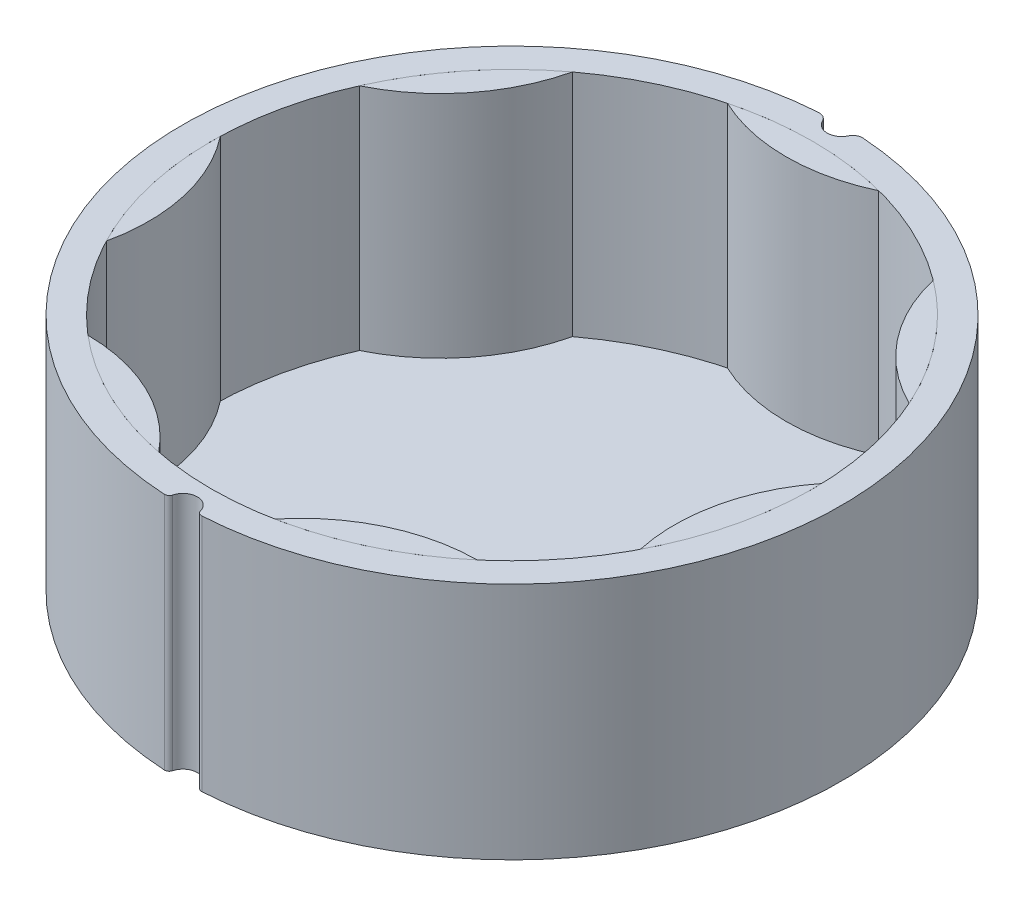
ISO-10303-21;
HEADER;
FILE_DESCRIPTION(('STEP AP214'),'2;1');
FILE_NAME('part.step','',(''),(''),'','','');
FILE_SCHEMA(('AUTOMOTIVE_DESIGN { 1 0 10303 214 1 1 1 1 }'));
ENDSEC;
DATA;
#1=APPLICATION_CONTEXT('core data for automotive mechanical design processes');
#2=APPLICATION_PROTOCOL_DEFINITION('international standard','automotive_design',2000,#1);
#3=PRODUCT_CONTEXT('',#1,'mechanical');
#4=PRODUCT('Part','Part','',(#3));
#5=PRODUCT_RELATED_PRODUCT_CATEGORY('part','',(#4));
#6=PRODUCT_DEFINITION_FORMATION('','',#4);
#7=PRODUCT_DEFINITION_CONTEXT('part definition',#1,'design');
#8=PRODUCT_DEFINITION('design','',#6,#7);
#9=PRODUCT_DEFINITION_SHAPE('','',#8);
#10=(LENGTH_UNIT() NAMED_UNIT(*) SI_UNIT(.MILLI.,.METRE.));
#11=(NAMED_UNIT(*) PLANE_ANGLE_UNIT() SI_UNIT($,.RADIAN.));
#12=(NAMED_UNIT(*) SI_UNIT($,.STERADIAN.) SOLID_ANGLE_UNIT());
#13=UNCERTAINTY_MEASURE_WITH_UNIT(LENGTH_MEASURE(1.E-05),#10,'distance_accuracy_value','');
#14=(GEOMETRIC_REPRESENTATION_CONTEXT(3) GLOBAL_UNCERTAINTY_ASSIGNED_CONTEXT((#13)) GLOBAL_UNIT_ASSIGNED_CONTEXT((#10,
#11,#12)) REPRESENTATION_CONTEXT('',''));
#15=CARTESIAN_POINT('',(0.,0.,0.));
#16=DIRECTION('',(0.,0.,1.));
#17=DIRECTION('',(1.,0.,0.));
#18=AXIS2_PLACEMENT_3D('',#15,#16,#17);
#19=CARTESIAN_POINT('',(0.,41.1155827714199,0.));
#20=DIRECTION('',(0.,-1.,0.));
#21=DIRECTION('',(0.781831482468022,0.,-0.623489801858743));
#22=AXIS2_PLACEMENT_3D('',#19,#20,#21);
#23=CYLINDRICAL_SURFACE('',#22,31.5);
#24=CARTESIAN_POINT('',(0.,25.,0.));
#25=DIRECTION('',(0.,1.,0.));
#26=DIRECTION('',(-0.781831482468022,0.,0.623489801858743));
#27=AXIS2_PLACEMENT_3D('',#24,#25,#26);
#28=CIRCLE('',#27,31.5);
#29=CARTESIAN_POINT('',(28.7809901560966,25.,-12.8025234088702));
#30=VERTEX_POINT('',#29);
#31=CARTESIAN_POINT('',(18.8859102273903,25.,-25.21056117747));
#32=VERTEX_POINT('',#31);
#33=EDGE_CURVE('E13',#30,#32,#28,.T.);
#34=ORIENTED_EDGE('',*,*,#33,.F.);
#35=DIRECTION('',(0.,-1.,0.));
#36=VECTOR('',#35,1.);
#37=CARTESIAN_POINT('',(28.7809901560966,41.1155827714199,-12.8025234088702));
#38=LINE('',#37,#36);
#39=CARTESIAN_POINT('',(28.7809901560966,0.,-12.8025234088702));
#40=VERTEX_POINT('',#39);
#41=EDGE_CURVE('E65',#30,#40,#38,.T.);
#42=ORIENTED_EDGE('',*,*,#41,.T.);
#43=CARTESIAN_POINT('',(0.,0.,0.));
#44=DIRECTION('',(0.,1.,0.));
#45=DIRECTION('',(-0.781831482468022,0.,0.623489801858743));
#46=AXIS2_PLACEMENT_3D('',#43,#44,#45);
#47=CIRCLE('',#46,31.5);
#48=CARTESIAN_POINT('',(18.8859102273903,0.,-25.21056117747));
#49=VERTEX_POINT('',#48);
#50=EDGE_CURVE('E91',#40,#49,#47,.T.);
#51=ORIENTED_EDGE('',*,*,#50,.T.);
#52=DIRECTION('',(0.,-1.,0.));
#53=VECTOR('',#52,1.);
#54=CARTESIAN_POINT('',(18.8859102273903,41.1155827714199,-25.21056117747));
#55=LINE('',#54,#53);
#56=EDGE_CURVE('E83',#32,#49,#55,.T.);
#57=ORIENTED_EDGE('',*,*,#56,.F.);
#58=EDGE_LOOP('',(#34,#42,#51,#57));
#59=FACE_BOUND('',#58,.T.);
#60=ADVANCED_FACE('F61',(#59),#23,.T.);
#61=CARTESIAN_POINT('',(36.9327732435188,41.1155827714199,-29.452903839335));
#62=DIRECTION('',(0.,-1.,0.));
#63=DIRECTION('',(0.781831482468022,0.,-0.623489801858743));
#64=AXIS2_PLACEMENT_3D('',#61,#62,#63);
#65=CYLINDRICAL_SURFACE('',#64,18.5387900355872);
#66=CARTESIAN_POINT('',(36.9327732435188,25.,-29.452903839335));
#67=DIRECTION('',(0.,1.,0.));
#68=DIRECTION('',(-0.781831482468022,0.,0.623489801858743));
#69=AXIS2_PLACEMENT_3D('',#66,#67,#68);
#70=CIRCLE('',#69,18.5387900355872);
#71=EDGE_CURVE('E71',#32,#30,#70,.T.);
#72=ORIENTED_EDGE('',*,*,#71,.F.);
#73=ORIENTED_EDGE('',*,*,#56,.T.);
#74=CARTESIAN_POINT('',(36.9327732435188,0.,-29.452903839335));
#75=DIRECTION('',(0.,1.,0.));
#76=DIRECTION('',(-0.781831482468022,0.,0.623489801858743));
#77=AXIS2_PLACEMENT_3D('',#74,#75,#76);
#78=CIRCLE('',#77,18.5387900355872);
#79=EDGE_CURVE('E94',#49,#40,#78,.T.);
#80=ORIENTED_EDGE('',*,*,#79,.T.);
#81=ORIENTED_EDGE('',*,*,#41,.F.);
#82=EDGE_LOOP('',(#72,#73,#80,#81));
#83=FACE_BOUND('',#82,.T.);
#84=ADVANCED_FACE('F95',(#83),#65,.T.);
#85=CARTESIAN_POINT('',(0.,0.,0.));
#86=DIRECTION('',(0.,1.,0.));
#87=DIRECTION('',(-0.781831482468022,0.,0.623489801858743));
#88=AXIS2_PLACEMENT_3D('',#85,#86,#87);
#89=PLANE('',#88);
#90=ORIENTED_EDGE('',*,*,#50,.F.);
#91=ORIENTED_EDGE('',*,*,#79,.F.);
#92=EDGE_LOOP('',(#90,#91));
#93=FACE_BOUND('',#92,.T.);
#94=ADVANCED_FACE('F99',(#93),#89,.F.);
#95=CARTESIAN_POINT('',(0.,25.,0.));
#96=DIRECTION('',(0.,1.,0.));
#97=DIRECTION('',(-0.781831482468022,0.,0.623489801858743));
#98=AXIS2_PLACEMENT_3D('',#95,#96,#97);
#99=PLANE('',#98);
#100=ORIENTED_EDGE('',*,*,#71,.T.);
#101=ORIENTED_EDGE('',*,*,#33,.T.);
#102=EDGE_LOOP('',(#100,#101));
#103=FACE_BOUND('',#102,.T.);
#104=ADVANCED_FACE('F63',(#103),#99,.T.);
#105=CLOSED_SHELL('',(#60,#84,#94,#104));
#106=MANIFOLD_SOLID_BREP('B2',#105);
#107=CARTESIAN_POINT('',(0.,41.1155827714199,0.));
#108=DIRECTION('',(0.,-1.,0.));
#109=DIRECTION('',(0.974927912181826,0.,0.222520933956305));
#110=AXIS2_PLACEMENT_3D('',#107,#108,#109);
#111=CYLINDRICAL_SURFACE('',#110,31.5);
#112=CARTESIAN_POINT('',(0.,25.,0.));
#113=DIRECTION('',(0.,1.,0.));
#114=DIRECTION('',(-0.974927912181826,0.,-0.222520933956305));
#115=AXIS2_PLACEMENT_3D('',#112,#113,#114);
#116=CIRCLE('',#115,31.5);
#117=CARTESIAN_POINT('',(27.9540697058115,25.,14.5196414171506));
#118=VERTEX_POINT('',#117);
#119=CARTESIAN_POINT('',(31.4855828448297,25.,-0.952928602449503));
#120=VERTEX_POINT('',#119);
#121=EDGE_CURVE('E59',#118,#120,#116,.T.);
#122=ORIENTED_EDGE('',*,*,#121,.F.);
#123=DIRECTION('',(0.,-1.,0.));
#124=VECTOR('',#123,1.);
#125=CARTESIAN_POINT('',(27.9540697058115,41.1155827714199,14.5196414171506));
#126=LINE('',#125,#124);
#127=CARTESIAN_POINT('',(27.9540697058115,0.,14.5196414171506));
#128=VERTEX_POINT('',#127);
#129=EDGE_CURVE('E167',#118,#128,#126,.T.);
#130=ORIENTED_EDGE('',*,*,#129,.T.);
#131=CARTESIAN_POINT('',(0.,0.,0.));
#132=DIRECTION('',(0.,1.,0.));
#133=DIRECTION('',(-0.974927912181826,0.,-0.222520933956305));
#134=AXIS2_PLACEMENT_3D('',#131,#132,#133);
#135=CIRCLE('',#134,31.5);
#136=CARTESIAN_POINT('',(31.4855828448297,0.,-0.952928602449503));
#137=VERTEX_POINT('',#136);
#138=EDGE_CURVE('E193',#128,#137,#135,.T.);
#139=ORIENTED_EDGE('',*,*,#138,.T.);
#140=DIRECTION('',(0.,-1.,0.));
#141=VECTOR('',#140,1.);
#142=CARTESIAN_POINT('',(31.4855828448297,41.1155827714199,-0.952928602449503));
#143=LINE('',#142,#141);
#144=EDGE_CURVE('E185',#120,#137,#143,.T.);
#145=ORIENTED_EDGE('',*,*,#144,.F.);
#146=EDGE_LOOP('',(#122,#130,#139,#145));
#147=FACE_BOUND('',#146,.T.);
#148=ADVANCED_FACE('F163',(#147),#111,.T.);
#149=CARTESIAN_POINT('',(46.0544149433907,41.1155827714199,10.5116196776847));
#150=DIRECTION('',(0.,-1.,0.));
#151=DIRECTION('',(0.974927912181826,0.,0.222520933956305));
#152=AXIS2_PLACEMENT_3D('',#149,#150,#151);
#153=CYLINDRICAL_SURFACE('',#152,18.5387900355872);
#154=CARTESIAN_POINT('',(46.0544149433907,25.,10.5116196776847));
#155=DIRECTION('',(0.,1.,0.));
#156=DIRECTION('',(-0.974927912181826,0.,-0.222520933956305));
#157=AXIS2_PLACEMENT_3D('',#154,#155,#156);
#158=CIRCLE('',#157,18.5387900355872);
#159=EDGE_CURVE('E173',#120,#118,#158,.T.);
#160=ORIENTED_EDGE('',*,*,#159,.F.);
#161=ORIENTED_EDGE('',*,*,#144,.T.);
#162=CARTESIAN_POINT('',(46.0544149433907,0.,10.5116196776847));
#163=DIRECTION('',(0.,1.,0.));
#164=DIRECTION('',(-0.974927912181826,0.,-0.222520933956305));
#165=AXIS2_PLACEMENT_3D('',#162,#163,#164);
#166=CIRCLE('',#165,18.5387900355872);
#167=EDGE_CURVE('E196',#137,#128,#166,.T.);
#168=ORIENTED_EDGE('',*,*,#167,.T.);
#169=ORIENTED_EDGE('',*,*,#129,.F.);
#170=EDGE_LOOP('',(#160,#161,#168,#169));
#171=FACE_BOUND('',#170,.T.);
#172=ADVANCED_FACE('F197',(#171),#153,.T.);
#173=CARTESIAN_POINT('',(0.,0.,0.));
#174=DIRECTION('',(0.,1.,0.));
#175=DIRECTION('',(-0.974927912181826,0.,-0.222520933956305));
#176=AXIS2_PLACEMENT_3D('',#173,#174,#175);
#177=PLANE('',#176);
#178=ORIENTED_EDGE('',*,*,#138,.F.);
#179=ORIENTED_EDGE('',*,*,#167,.F.);
#180=EDGE_LOOP('',(#178,#179));
#181=FACE_BOUND('',#180,.T.);
#182=ADVANCED_FACE('F201',(#181),#177,.F.);
#183=CARTESIAN_POINT('',(0.,25.,0.));
#184=DIRECTION('',(0.,1.,0.));
#185=DIRECTION('',(-0.974927912181826,0.,-0.222520933956305));
#186=AXIS2_PLACEMENT_3D('',#183,#184,#185);
#187=PLANE('',#186);
#188=ORIENTED_EDGE('',*,*,#159,.T.);
#189=ORIENTED_EDGE('',*,*,#121,.T.);
#190=EDGE_LOOP('',(#188,#189));
#191=FACE_BOUND('',#190,.T.);
#192=ADVANCED_FACE('F165',(#191),#187,.T.);
#193=CLOSED_SHELL('',(#148,#172,#182,#192));
#194=MANIFOLD_SOLID_BREP('B7',#193);
#195=CARTESIAN_POINT('',(0.,41.1155827714199,0.));
#196=DIRECTION('',(0.,-1.,0.));
#197=DIRECTION('',(0.433883739117565,0.,0.900968867902416));
#198=AXIS2_PLACEMENT_3D('',#195,#196,#197);
#199=CYLINDRICAL_SURFACE('',#198,31.5);
#200=CARTESIAN_POINT('',(0.,25.,0.));
#201=DIRECTION('',(0.,1.,0.));
#202=DIRECTION('',(-0.433883739117565,0.,-0.900968867902416));
#203=AXIS2_PLACEMENT_3D('',#200,#201,#202);
#204=CIRCLE('',#203,31.5);
#205=CARTESIAN_POINT('',(6.07716460794653,25.,30.9082201093483));
#206=VERTEX_POINT('',#205);
#207=CARTESIAN_POINT('',(20.3759693912688,25.,24.0222786464164));
#208=VERTEX_POINT('',#207);
#209=EDGE_CURVE('E161',#206,#208,#204,.T.);
#210=ORIENTED_EDGE('',*,*,#209,.F.);
#211=DIRECTION('',(0.,-1.,0.));
#212=VECTOR('',#211,1.);
#213=CARTESIAN_POINT('',(6.07716460794652,41.1155827714199,30.9082201093483));
#214=LINE('',#213,#212);
#215=CARTESIAN_POINT('',(6.07716460794652,0.,30.9082201093483));
#216=VERTEX_POINT('',#215);
#217=EDGE_CURVE('E269',#206,#216,#214,.T.);
#218=ORIENTED_EDGE('',*,*,#217,.T.);
#219=CARTESIAN_POINT('',(0.,0.,0.));
#220=DIRECTION('',(0.,1.,0.));
#221=DIRECTION('',(-0.433883739117565,0.,-0.900968867902416));
#222=AXIS2_PLACEMENT_3D('',#219,#220,#221);
#223=CIRCLE('',#222,31.5);
#224=CARTESIAN_POINT('',(20.3759693912688,0.,24.0222786464164));
#225=VERTEX_POINT('',#224);
#226=EDGE_CURVE('E295',#216,#225,#223,.T.);
#227=ORIENTED_EDGE('',*,*,#226,.T.);
#228=DIRECTION('',(0.,-1.,0.));
#229=VECTOR('',#228,1.);
#230=CARTESIAN_POINT('',(20.3759693912688,41.1155827714199,24.0222786464164));
#231=LINE('',#230,#229);
#232=EDGE_CURVE('E287',#208,#225,#231,.T.);
#233=ORIENTED_EDGE('',*,*,#232,.F.);
#234=EDGE_LOOP('',(#210,#218,#227,#233));
#235=FACE_BOUND('',#234,.T.);
#236=ADVANCED_FACE('F265',(#235),#199,.T.);
#237=CARTESIAN_POINT('',(20.4961428520302,41.1155827714199,42.5606791794429));
#238=DIRECTION('',(0.,-1.,0.));
#239=DIRECTION('',(0.433883739117565,0.,0.900968867902416));
#240=AXIS2_PLACEMENT_3D('',#237,#238,#239);
#241=CYLINDRICAL_SURFACE('',#240,18.5387900355872);
#242=CARTESIAN_POINT('',(20.4961428520302,25.,42.5606791794429));
#243=DIRECTION('',(0.,1.,0.));
#244=DIRECTION('',(-0.433883739117565,0.,-0.900968867902416));
#245=AXIS2_PLACEMENT_3D('',#242,#243,#244);
#246=CIRCLE('',#245,18.5387900355872);
#247=EDGE_CURVE('E275',#208,#206,#246,.T.);
#248=ORIENTED_EDGE('',*,*,#247,.F.);
#249=ORIENTED_EDGE('',*,*,#232,.T.);
#250=CARTESIAN_POINT('',(20.4961428520302,0.,42.5606791794429));
#251=DIRECTION('',(0.,1.,0.));
#252=DIRECTION('',(-0.433883739117565,0.,-0.900968867902416));
#253=AXIS2_PLACEMENT_3D('',#250,#251,#252);
#254=CIRCLE('',#253,18.5387900355872);
#255=EDGE_CURVE('E298',#225,#216,#254,.T.);
#256=ORIENTED_EDGE('',*,*,#255,.T.);
#257=ORIENTED_EDGE('',*,*,#217,.F.);
#258=EDGE_LOOP('',(#248,#249,#256,#257));
#259=FACE_BOUND('',#258,.T.);
#260=ADVANCED_FACE('F299',(#259),#241,.T.);
#261=CARTESIAN_POINT('',(0.,0.,0.));
#262=DIRECTION('',(0.,1.,0.));
#263=DIRECTION('',(-0.433883739117565,0.,-0.900968867902416));
#264=AXIS2_PLACEMENT_3D('',#261,#262,#263);
#265=PLANE('',#264);
#266=ORIENTED_EDGE('',*,*,#226,.F.);
#267=ORIENTED_EDGE('',*,*,#255,.F.);
#268=EDGE_LOOP('',(#266,#267));
#269=FACE_BOUND('',#268,.T.);
#270=ADVANCED_FACE('F303',(#269),#265,.F.);
#271=CARTESIAN_POINT('',(0.,25.,0.));
#272=DIRECTION('',(0.,1.,0.));
#273=DIRECTION('',(-0.433883739117565,0.,-0.900968867902416));
#274=AXIS2_PLACEMENT_3D('',#271,#272,#273);
#275=PLANE('',#274);
#276=ORIENTED_EDGE('',*,*,#247,.T.);
#277=ORIENTED_EDGE('',*,*,#209,.T.);
#278=EDGE_LOOP('',(#276,#277));
#279=FACE_BOUND('',#278,.T.);
#280=ADVANCED_FACE('F267',(#279),#275,.T.);
#281=CLOSED_SHELL('',(#236,#260,#270,#280));
#282=MANIFOLD_SOLID_BREP('B53',#281);
#283=CARTESIAN_POINT('',(0.,41.1155827714199,0.));
#284=DIRECTION('',(0.,-1.,0.));
#285=DIRECTION('',(-0.433883739117553,0.,0.900968867902422));
#286=AXIS2_PLACEMENT_3D('',#283,#284,#285);
#287=CYLINDRICAL_SURFACE('',#286,31.5);
#288=CARTESIAN_POINT('',(0.,25.,0.));
#289=DIRECTION('',(0.,1.,0.));
#290=DIRECTION('',(0.433883739117553,0.,-0.900968867902422));
#291=AXIS2_PLACEMENT_3D('',#288,#289,#290);
#292=CIRCLE('',#291,31.5);
#293=CARTESIAN_POINT('',(-20.3759693912685,25.,24.0222786464167));
#294=VERTEX_POINT('',#293);
#295=CARTESIAN_POINT('',(-6.07716460794609,25.,30.9082201093484));
#296=VERTEX_POINT('',#295);
#297=EDGE_CURVE('E263',#294,#296,#292,.T.);
#298=ORIENTED_EDGE('',*,*,#297,.F.);
#299=DIRECTION('',(0.,-1.,0.));
#300=VECTOR('',#299,1.);
#301=CARTESIAN_POINT('',(-20.3759693912685,41.1155827714199,24.0222786464167));
#302=LINE('',#301,#300);
#303=CARTESIAN_POINT('',(-20.3759693912685,0.,24.0222786464167));
#304=VERTEX_POINT('',#303);
#305=EDGE_CURVE('E371',#294,#304,#302,.T.);
#306=ORIENTED_EDGE('',*,*,#305,.T.);
#307=CARTESIAN_POINT('',(0.,0.,0.));
#308=DIRECTION('',(0.,1.,0.));
#309=DIRECTION('',(0.433883739117553,0.,-0.900968867902422));
#310=AXIS2_PLACEMENT_3D('',#307,#308,#309);
#311=CIRCLE('',#310,31.5);
#312=CARTESIAN_POINT('',(-6.07716460794609,0.,30.9082201093484));
#313=VERTEX_POINT('',#312);
#314=EDGE_CURVE('E397',#304,#313,#311,.T.);
#315=ORIENTED_EDGE('',*,*,#314,.T.);
#316=DIRECTION('',(0.,-1.,0.));
#317=VECTOR('',#316,1.);
#318=CARTESIAN_POINT('',(-6.07716460794609,41.1155827714199,30.9082201093484));
#319=LINE('',#318,#317);
#320=EDGE_CURVE('E389',#296,#313,#319,.T.);
#321=ORIENTED_EDGE('',*,*,#320,.F.);
#322=EDGE_LOOP('',(#298,#306,#315,#321));
#323=FACE_BOUND('',#322,.T.);
#324=ADVANCED_FACE('F367',(#323),#287,.T.);
#325=CARTESIAN_POINT('',(-20.4961428520296,41.1155827714199,42.5606791794432));
#326=DIRECTION('',(0.,-1.,0.));
#327=DIRECTION('',(-0.433883739117553,0.,0.900968867902422));
#328=AXIS2_PLACEMENT_3D('',#325,#326,#327);
#329=CYLINDRICAL_SURFACE('',#328,18.5387900355872);
#330=CARTESIAN_POINT('',(-20.4961428520296,25.,42.5606791794432));
#331=DIRECTION('',(0.,1.,0.));
#332=DIRECTION('',(0.433883739117553,0.,-0.900968867902422));
#333=AXIS2_PLACEMENT_3D('',#330,#331,#332);
#334=CIRCLE('',#333,18.5387900355872);
#335=EDGE_CURVE('E377',#296,#294,#334,.T.);
#336=ORIENTED_EDGE('',*,*,#335,.F.);
#337=ORIENTED_EDGE('',*,*,#320,.T.);
#338=CARTESIAN_POINT('',(-20.4961428520296,0.,42.5606791794432));
#339=DIRECTION('',(0.,1.,0.));
#340=DIRECTION('',(0.433883739117553,0.,-0.900968867902422));
#341=AXIS2_PLACEMENT_3D('',#338,#339,#340);
#342=CIRCLE('',#341,18.5387900355872);
#343=EDGE_CURVE('E400',#313,#304,#342,.T.);
#344=ORIENTED_EDGE('',*,*,#343,.T.);
#345=ORIENTED_EDGE('',*,*,#305,.F.);
#346=EDGE_LOOP('',(#336,#337,#344,#345));
#347=FACE_BOUND('',#346,.T.);
#348=ADVANCED_FACE('F401',(#347),#329,.T.);
#349=CARTESIAN_POINT('',(0.,0.,0.));
#350=DIRECTION('',(0.,1.,0.));
#351=DIRECTION('',(0.433883739117553,0.,-0.900968867902422));
#352=AXIS2_PLACEMENT_3D('',#349,#350,#351);
#353=PLANE('',#352);
#354=ORIENTED_EDGE('',*,*,#314,.F.);
#355=ORIENTED_EDGE('',*,*,#343,.F.);
#356=EDGE_LOOP('',(#354,#355));
#357=FACE_BOUND('',#356,.T.);
#358=ADVANCED_FACE('F405',(#357),#353,.F.);
#359=CARTESIAN_POINT('',(0.,25.,0.));
#360=DIRECTION('',(0.,1.,0.));
#361=DIRECTION('',(0.433883739117553,0.,-0.900968867902422));
#362=AXIS2_PLACEMENT_3D('',#359,#360,#361);
#363=PLANE('',#362);
#364=ORIENTED_EDGE('',*,*,#335,.T.);
#365=ORIENTED_EDGE('',*,*,#297,.T.);
#366=EDGE_LOOP('',(#364,#365));
#367=FACE_BOUND('',#366,.T.);
#368=ADVANCED_FACE('F369',(#367),#363,.T.);
#369=CLOSED_SHELL('',(#324,#348,#358,#368));
#370=MANIFOLD_SOLID_BREP('B155',#369);
#371=CARTESIAN_POINT('',(0.,41.1155827714199,0.));
#372=DIRECTION('',(0.,-1.,0.));
#373=DIRECTION('',(-0.974927912181823,0.,0.222520933956318));
#374=AXIS2_PLACEMENT_3D('',#371,#372,#373);
#375=CYLINDRICAL_SURFACE('',#374,31.5);
#376=CARTESIAN_POINT('',(0.,25.,0.));
#377=DIRECTION('',(0.,1.,0.));
#378=DIRECTION('',(0.974927912181823,0.,-0.222520933956318));
#379=AXIS2_PLACEMENT_3D('',#376,#377,#378);
#380=CIRCLE('',#379,31.5);
#381=CARTESIAN_POINT('',(-31.4855828448297,25.,-0.952928602449062));
#382=VERTEX_POINT('',#381);
#383=CARTESIAN_POINT('',(-27.9540697058113,25.,14.519641417151));
#384=VERTEX_POINT('',#383);
#385=EDGE_CURVE('E365',#382,#384,#380,.T.);
#386=ORIENTED_EDGE('',*,*,#385,.F.);
#387=DIRECTION('',(0.,-1.,0.));
#388=VECTOR('',#387,1.);
#389=CARTESIAN_POINT('',(-31.4855828448297,41.1155827714199,-0.95292860244907));
#390=LINE('',#389,#388);
#391=CARTESIAN_POINT('',(-31.4855828448297,0.,-0.95292860244907));
#392=VERTEX_POINT('',#391);
#393=EDGE_CURVE('E473',#382,#392,#390,.T.);
#394=ORIENTED_EDGE('',*,*,#393,.T.);
#395=CARTESIAN_POINT('',(0.,0.,0.));
#396=DIRECTION('',(0.,1.,0.));
#397=DIRECTION('',(0.974927912181823,0.,-0.222520933956318));
#398=AXIS2_PLACEMENT_3D('',#395,#396,#397);
#399=CIRCLE('',#398,31.5);
#400=CARTESIAN_POINT('',(-27.9540697058113,0.,14.519641417151));
#401=VERTEX_POINT('',#400);
#402=EDGE_CURVE('E499',#392,#401,#399,.T.);
#403=ORIENTED_EDGE('',*,*,#402,.T.);
#404=DIRECTION('',(0.,-1.,0.));
#405=VECTOR('',#404,1.);
#406=CARTESIAN_POINT('',(-27.9540697058113,41.1155827714199,14.519641417151));
#407=LINE('',#406,#405);
#408=EDGE_CURVE('E491',#384,#401,#407,.T.);
#409=ORIENTED_EDGE('',*,*,#408,.F.);
#410=EDGE_LOOP('',(#386,#394,#403,#409));
#411=FACE_BOUND('',#410,.T.);
#412=ADVANCED_FACE('F469',(#411),#375,.T.);
#413=CARTESIAN_POINT('',(-46.0544149433905,41.1155827714199,10.5116196776853));
#414=DIRECTION('',(0.,-1.,0.));
#415=DIRECTION('',(-0.974927912181823,0.,0.222520933956318));
#416=AXIS2_PLACEMENT_3D('',#413,#414,#415);
#417=CYLINDRICAL_SURFACE('',#416,18.5387900355872);
#418=CARTESIAN_POINT('',(-46.0544149433905,25.,10.5116196776853));
#419=DIRECTION('',(0.,1.,0.));
#420=DIRECTION('',(0.974927912181823,0.,-0.222520933956318));
#421=AXIS2_PLACEMENT_3D('',#418,#419,#420);
#422=CIRCLE('',#421,18.5387900355872);
#423=EDGE_CURVE('E479',#384,#382,#422,.T.);
#424=ORIENTED_EDGE('',*,*,#423,.F.);
#425=ORIENTED_EDGE('',*,*,#408,.T.);
#426=CARTESIAN_POINT('',(-46.0544149433905,0.,10.5116196776853));
#427=DIRECTION('',(0.,1.,0.));
#428=DIRECTION('',(0.974927912181823,0.,-0.222520933956318));
#429=AXIS2_PLACEMENT_3D('',#426,#427,#428);
#430=CIRCLE('',#429,18.5387900355872);
#431=EDGE_CURVE('E502',#401,#392,#430,.T.);
#432=ORIENTED_EDGE('',*,*,#431,.T.);
#433=ORIENTED_EDGE('',*,*,#393,.F.);
#434=EDGE_LOOP('',(#424,#425,#432,#433));
#435=FACE_BOUND('',#434,.T.);
#436=ADVANCED_FACE('F503',(#435),#417,.T.);
#437=CARTESIAN_POINT('',(0.,0.,0.));
#438=DIRECTION('',(0.,1.,0.));
#439=DIRECTION('',(0.974927912181823,0.,-0.222520933956318));
#440=AXIS2_PLACEMENT_3D('',#437,#438,#439);
#441=PLANE('',#440);
#442=ORIENTED_EDGE('',*,*,#402,.F.);
#443=ORIENTED_EDGE('',*,*,#431,.F.);
#444=EDGE_LOOP('',(#442,#443));
#445=FACE_BOUND('',#444,.T.);
#446=ADVANCED_FACE('F507',(#445),#441,.F.);
#447=CARTESIAN_POINT('',(0.,25.,0.));
#448=DIRECTION('',(0.,1.,0.));
#449=DIRECTION('',(0.974927912181823,0.,-0.222520933956318));
#450=AXIS2_PLACEMENT_3D('',#447,#448,#449);
#451=PLANE('',#450);
#452=ORIENTED_EDGE('',*,*,#423,.T.);
#453=ORIENTED_EDGE('',*,*,#385,.T.);
#454=EDGE_LOOP('',(#452,#453));
#455=FACE_BOUND('',#454,.T.);
#456=ADVANCED_FACE('F471',(#455),#451,.T.);
#457=CLOSED_SHELL('',(#412,#436,#446,#456));
#458=MANIFOLD_SOLID_BREP('B257',#457);
#459=CARTESIAN_POINT('',(0.,41.1155827714199,0.));
#460=DIRECTION('',(0.,-1.,0.));
#461=DIRECTION('',(-0.781831482468031,0.,-0.623489801858732));
#462=AXIS2_PLACEMENT_3D('',#459,#460,#461);
#463=CYLINDRICAL_SURFACE('',#462,31.5);
#464=CARTESIAN_POINT('',(0.,25.,0.));
#465=DIRECTION('',(0.,1.,0.));
#466=DIRECTION('',(0.781831482468031,0.,0.623489801858732));
#467=AXIS2_PLACEMENT_3D('',#464,#465,#466);
#468=CIRCLE('',#467,31.5);
#469=CARTESIAN_POINT('',(-18.8859102273906,25.,-25.2105611774697));
#470=VERTEX_POINT('',#469);
#471=CARTESIAN_POINT('',(-28.7809901560968,25.,-12.8025234088698));
#472=VERTEX_POINT('',#471);
#473=EDGE_CURVE('E467',#470,#472,#468,.T.);
#474=ORIENTED_EDGE('',*,*,#473,.F.);
#475=DIRECTION('',(0.,-1.,0.));
#476=VECTOR('',#475,1.);
#477=CARTESIAN_POINT('',(-18.8859102273906,41.1155827714199,-25.2105611774697));
#478=LINE('',#477,#476);
#479=CARTESIAN_POINT('',(-18.8859102273906,0.,-25.2105611774697));
#480=VERTEX_POINT('',#479);
#481=EDGE_CURVE('E575',#470,#480,#478,.T.);
#482=ORIENTED_EDGE('',*,*,#481,.T.);
#483=CARTESIAN_POINT('',(0.,0.,0.));
#484=DIRECTION('',(0.,1.,0.));
#485=DIRECTION('',(0.781831482468031,0.,0.623489801858732));
#486=AXIS2_PLACEMENT_3D('',#483,#484,#485);
#487=CIRCLE('',#486,31.5);
#488=CARTESIAN_POINT('',(-28.7809901560968,0.,-12.8025234088698));
#489=VERTEX_POINT('',#488);
#490=EDGE_CURVE('E601',#480,#489,#487,.T.);
#491=ORIENTED_EDGE('',*,*,#490,.T.);
#492=DIRECTION('',(0.,-1.,0.));
#493=VECTOR('',#492,1.);
#494=CARTESIAN_POINT('',(-28.7809901560968,41.1155827714199,-12.8025234088698));
#495=LINE('',#494,#493);
#496=EDGE_CURVE('E593',#472,#489,#495,.T.);
#497=ORIENTED_EDGE('',*,*,#496,.F.);
#498=EDGE_LOOP('',(#474,#482,#491,#497));
#499=FACE_BOUND('',#498,.T.);
#500=ADVANCED_FACE('F571',(#499),#463,.T.);
#501=CARTESIAN_POINT('',(-36.9327732435192,41.1155827714199,-29.4529038393345));
#502=DIRECTION('',(0.,-1.,0.));
#503=DIRECTION('',(-0.781831482468031,0.,-0.623489801858732));
#504=AXIS2_PLACEMENT_3D('',#501,#502,#503);
#505=CYLINDRICAL_SURFACE('',#504,18.5387900355872);
#506=CARTESIAN_POINT('',(-36.9327732435192,25.,-29.4529038393345));
#507=DIRECTION('',(0.,1.,0.));
#508=DIRECTION('',(0.781831482468031,0.,0.623489801858732));
#509=AXIS2_PLACEMENT_3D('',#506,#507,#508);
#510=CIRCLE('',#509,18.5387900355872);
#511=EDGE_CURVE('E581',#472,#470,#510,.T.);
#512=ORIENTED_EDGE('',*,*,#511,.F.);
#513=ORIENTED_EDGE('',*,*,#496,.T.);
#514=CARTESIAN_POINT('',(-36.9327732435192,0.,-29.4529038393345));
#515=DIRECTION('',(0.,1.,0.));
#516=DIRECTION('',(0.781831482468031,0.,0.623489801858732));
#517=AXIS2_PLACEMENT_3D('',#514,#515,#516);
#518=CIRCLE('',#517,18.5387900355872);
#519=EDGE_CURVE('E604',#489,#480,#518,.T.);
#520=ORIENTED_EDGE('',*,*,#519,.T.);
#521=ORIENTED_EDGE('',*,*,#481,.F.);
#522=EDGE_LOOP('',(#512,#513,#520,#521));
#523=FACE_BOUND('',#522,.T.);
#524=ADVANCED_FACE('F605',(#523),#505,.T.);
#525=CARTESIAN_POINT('',(0.,0.,0.));
#526=DIRECTION('',(0.,1.,0.));
#527=DIRECTION('',(0.781831482468031,0.,0.623489801858732));
#528=AXIS2_PLACEMENT_3D('',#525,#526,#527);
#529=PLANE('',#528);
#530=ORIENTED_EDGE('',*,*,#490,.F.);
#531=ORIENTED_EDGE('',*,*,#519,.F.);
#532=EDGE_LOOP('',(#530,#531));
#533=FACE_BOUND('',#532,.T.);
#534=ADVANCED_FACE('F609',(#533),#529,.F.);
#535=CARTESIAN_POINT('',(0.,25.,0.));
#536=DIRECTION('',(0.,1.,0.));
#537=DIRECTION('',(0.781831482468031,0.,0.623489801858732));
#538=AXIS2_PLACEMENT_3D('',#535,#536,#537);
#539=PLANE('',#538);
#540=ORIENTED_EDGE('',*,*,#511,.T.);
#541=ORIENTED_EDGE('',*,*,#473,.T.);
#542=EDGE_LOOP('',(#540,#541));
#543=FACE_BOUND('',#542,.T.);
#544=ADVANCED_FACE('F573',(#543),#539,.T.);
#545=CLOSED_SHELL('',(#500,#524,#534,#544));
#546=MANIFOLD_SOLID_BREP('B359',#545);
#547=CARTESIAN_POINT('',(0.,41.1155827714199,0.));
#548=DIRECTION('',(0.,-1.,0.));
#549=DIRECTION('',(0.,0.,-1.));
#550=AXIS2_PLACEMENT_3D('',#547,#548,#549);
#551=CYLINDRICAL_SURFACE('',#550,31.5);
#552=CARTESIAN_POINT('',(0.,25.,0.));
#553=DIRECTION('',(0.,1.,0.));
#554=DIRECTION('',(0.,0.,1.));
#555=AXIS2_PLACEMENT_3D('',#552,#553,#554);
#556=CIRCLE('',#555,31.5);
#557=CARTESIAN_POINT('',(7.93523799363454,25.,-30.484126984127));
#558=VERTEX_POINT('',#557);
#559=CARTESIAN_POINT('',(-7.93523799363456,25.,-30.484126984127));
#560=VERTEX_POINT('',#559);
#561=EDGE_CURVE('E569',#558,#560,#556,.T.);
#562=ORIENTED_EDGE('',*,*,#561,.F.);
#563=DIRECTION('',(0.,-1.,0.));
#564=VECTOR('',#563,1.);
#565=CARTESIAN_POINT('',(7.93523799363455,41.1155827714199,-30.484126984127));
#566=LINE('',#565,#564);
#567=CARTESIAN_POINT('',(7.93523799363455,0.,-30.484126984127));
#568=VERTEX_POINT('',#567);
#569=EDGE_CURVE('E676',#558,#568,#566,.T.);
#570=ORIENTED_EDGE('',*,*,#569,.T.);
#571=CARTESIAN_POINT('',(0.,0.,0.));
#572=DIRECTION('',(0.,1.,0.));
#573=DIRECTION('',(0.,0.,1.));
#574=AXIS2_PLACEMENT_3D('',#571,#572,#573);
#575=CIRCLE('',#574,31.5);
#576=CARTESIAN_POINT('',(-7.93523799363456,0.,-30.484126984127));
#577=VERTEX_POINT('',#576);
#578=EDGE_CURVE('E702',#568,#577,#575,.T.);
#579=ORIENTED_EDGE('',*,*,#578,.T.);
#580=DIRECTION('',(0.,-1.,0.));
#581=VECTOR('',#580,1.);
#582=CARTESIAN_POINT('',(-7.93523799363456,41.1155827714199,-30.484126984127));
#583=LINE('',#582,#581);
#584=EDGE_CURVE('E694',#560,#577,#583,.T.);
#585=ORIENTED_EDGE('',*,*,#584,.F.);
#586=EDGE_LOOP('',(#562,#570,#579,#585));
#587=FACE_BOUND('',#586,.T.);
#588=ADVANCED_FACE('F672',(#587),#551,.T.);
#589=CARTESIAN_POINT('',(0.,41.1155827714199,-47.2387900355872));
#590=DIRECTION('',(0.,-1.,0.));
#591=DIRECTION('',(0.,0.,-1.));
#592=AXIS2_PLACEMENT_3D('',#589,#590,#591);
#593=CYLINDRICAL_SURFACE('',#592,18.5387900355872);
#594=CARTESIAN_POINT('',(0.,25.,-47.2387900355872));
#595=DIRECTION('',(0.,1.,0.));
#596=DIRECTION('',(0.,0.,1.));
#597=AXIS2_PLACEMENT_3D('',#594,#595,#596);
#598=CIRCLE('',#597,18.5387900355872);
#599=EDGE_CURVE('E682',#560,#558,#598,.T.);
#600=ORIENTED_EDGE('',*,*,#599,.F.);
#601=ORIENTED_EDGE('',*,*,#584,.T.);
#602=CARTESIAN_POINT('',(0.,0.,-47.2387900355872));
#603=DIRECTION('',(0.,1.,0.));
#604=DIRECTION('',(0.,0.,1.));
#605=AXIS2_PLACEMENT_3D('',#602,#603,#604);
#606=CIRCLE('',#605,18.5387900355872);
#607=EDGE_CURVE('E705',#577,#568,#606,.T.);
#608=ORIENTED_EDGE('',*,*,#607,.T.);
#609=ORIENTED_EDGE('',*,*,#569,.F.);
#610=EDGE_LOOP('',(#600,#601,#608,#609));
#611=FACE_BOUND('',#610,.T.);
#612=ADVANCED_FACE('F706',(#611),#593,.T.);
#613=CARTESIAN_POINT('',(0.,0.,0.));
#614=DIRECTION('',(0.,1.,0.));
#615=DIRECTION('',(0.,0.,1.));
#616=AXIS2_PLACEMENT_3D('',#613,#614,#615);
#617=PLANE('',#616);
#618=ORIENTED_EDGE('',*,*,#578,.F.);
#619=ORIENTED_EDGE('',*,*,#607,.F.);
#620=EDGE_LOOP('',(#618,#619));
#621=FACE_BOUND('',#620,.T.);
#622=ADVANCED_FACE('F710',(#621),#617,.F.);
#623=CARTESIAN_POINT('',(0.,25.,0.));
#624=DIRECTION('',(0.,1.,0.));
#625=DIRECTION('',(0.,0.,1.));
#626=AXIS2_PLACEMENT_3D('',#623,#624,#625);
#627=PLANE('',#626);
#628=ORIENTED_EDGE('',*,*,#599,.T.);
#629=ORIENTED_EDGE('',*,*,#561,.T.);
#630=EDGE_LOOP('',(#628,#629));
#631=FACE_BOUND('',#630,.T.);
#632=ADVANCED_FACE('F674',(#631),#627,.T.);
#633=CLOSED_SHELL('',(#588,#612,#622,#632));
#634=MANIFOLD_SOLID_BREP('B461',#633);
#635=CARTESIAN_POINT('',(-1.93575856721061,25.,33.9428491683965));
#636=DIRECTION('',(0.,-1.,0.));
#637=DIRECTION('',(0.,0.,-1.));
#638=AXIS2_PLACEMENT_3D('',#635,#636,#637);
#639=CYLINDRICAL_SURFACE('',#638,0.500000000000003);
#640=CARTESIAN_POINT('',(-1.93575856721061,0.,33.9428491683965));
#641=DIRECTION('',(0.,1.,0.));
#642=DIRECTION('',(0.,0.,1.));
#643=AXIS2_PLACEMENT_3D('',#640,#641,#642);
#644=CIRCLE('',#643,0.500000000000003);
#645=CARTESIAN_POINT('',(-1.45181892540796,0.,34.0685568574689));
#646=VERTEX_POINT('',#645);
#647=CARTESIAN_POINT('',(-1.96422560496371,0.,34.4420381383884));
#648=VERTEX_POINT('',#647);
#649=EDGE_CURVE('E864',#646,#648,#644,.F.);
#650=ORIENTED_EDGE('',*,*,#649,.F.);
#651=DIRECTION('',(0.,-1.,0.));
#652=VECTOR('',#651,1.);
#653=CARTESIAN_POINT('',(-1.45181892540796,25.,34.0685568574689));
#654=LINE('',#653,#652);
#655=CARTESIAN_POINT('',(-1.45181892540796,25.,34.0685568574689));
#656=VERTEX_POINT('',#655);
#657=EDGE_CURVE('E670',#656,#646,#654,.T.);
#658=ORIENTED_EDGE('',*,*,#657,.F.);
#659=CARTESIAN_POINT('',(-1.93575856721061,25.,33.9428491683965));
#660=DIRECTION('',(0.,1.,0.));
#661=DIRECTION('',(0.,0.,1.));
#662=AXIS2_PLACEMENT_3D('',#659,#660,#661);
#663=CIRCLE('',#662,0.500000000000003);
#664=CARTESIAN_POINT('',(-1.96422560496371,25.,34.4420381383884));
#665=VERTEX_POINT('',#664);
#666=EDGE_CURVE('E891',#656,#665,#663,.F.);
#667=ORIENTED_EDGE('',*,*,#666,.T.);
#668=DIRECTION('',(0.,-1.,0.));
#669=VECTOR('',#668,1.);
#670=CARTESIAN_POINT('',(-1.96422560496371,25.,34.4420381383884));
#671=LINE('',#670,#669);
#672=EDGE_CURVE('E815',#665,#648,#671,.T.);
#673=ORIENTED_EDGE('',*,*,#672,.T.);
#674=EDGE_LOOP('',(#650,#658,#667,#673));
#675=FACE_BOUND('',#674,.T.);
#676=ADVANCED_FACE('F764',(#675),#639,.T.);
#677=CARTESIAN_POINT('',(0.,25.,34.4456799246862));
#678=DIRECTION('',(0.,-1.,0.));
#679=DIRECTION('',(0.,0.,-1.));
#680=AXIS2_PLACEMENT_3D('',#677,#678,#679);
#681=CYLINDRICAL_SURFACE('',#680,1.50000000000002);
#682=CARTESIAN_POINT('',(0.,0.,34.4456799246862));
#683=DIRECTION('',(0.,1.,0.));
#684=DIRECTION('',(0.,0.,1.));
#685=AXIS2_PLACEMENT_3D('',#682,#683,#684);
#686=CIRCLE('',#685,1.50000000000002);
#687=CARTESIAN_POINT('',(1.45181892540796,0.,34.0685568574689));
#688=VERTEX_POINT('',#687);
#689=EDGE_CURVE('E868',#688,#646,#686,.T.);
#690=ORIENTED_EDGE('',*,*,#689,.F.);
#691=DIRECTION('',(0.,-1.,0.));
#692=VECTOR('',#691,1.);
#693=CARTESIAN_POINT('',(1.45181892540796,25.,34.0685568574689));
#694=LINE('',#693,#692);
#695=CARTESIAN_POINT('',(1.45181892540796,25.,34.0685568574689));
#696=VERTEX_POINT('',#695);
#697=EDGE_CURVE('E773',#696,#688,#694,.T.);
#698=ORIENTED_EDGE('',*,*,#697,.F.);
#699=CARTESIAN_POINT('',(0.,25.,34.4456799246862));
#700=DIRECTION('',(0.,1.,0.));
#701=DIRECTION('',(0.,0.,1.));
#702=AXIS2_PLACEMENT_3D('',#699,#700,#701);
#703=CIRCLE('',#702,1.50000000000002);
#704=EDGE_CURVE('E920',#696,#656,#703,.T.);
#705=ORIENTED_EDGE('',*,*,#704,.T.);
#706=ORIENTED_EDGE('',*,*,#657,.T.);
#707=EDGE_LOOP('',(#690,#698,#705,#706));
#708=FACE_BOUND('',#707,.T.);
#709=ADVANCED_FACE('F919',(#708),#681,.F.);
#710=CARTESIAN_POINT('',(1.93575856721061,25.,33.9428491683965));
#711=DIRECTION('',(0.,-1.,0.));
#712=DIRECTION('',(0.,0.,-1.));
#713=AXIS2_PLACEMENT_3D('',#710,#711,#712);
#714=CYLINDRICAL_SURFACE('',#713,0.500000000000003);
#715=CARTESIAN_POINT('',(1.93575856721061,0.,33.9428491683965));
#716=DIRECTION('',(0.,1.,0.));
#717=DIRECTION('',(0.,0.,1.));
#718=AXIS2_PLACEMENT_3D('',#715,#716,#717);
#719=CIRCLE('',#718,0.500000000000003);
#720=CARTESIAN_POINT('',(1.9642256049637,0.,34.4420381383884));
#721=VERTEX_POINT('',#720);
#722=EDGE_CURVE('E873',#688,#721,#719,.T.);
#723=ORIENTED_EDGE('',*,*,#722,.T.);
#724=DIRECTION('',(0.,-1.,0.));
#725=VECTOR('',#724,1.);
#726=CARTESIAN_POINT('',(1.9642256049637,25.,34.4420381383884));
#727=LINE('',#726,#725);
#728=CARTESIAN_POINT('',(1.9642256049637,25.,34.4420381383884));
#729=VERTEX_POINT('',#728);
#730=EDGE_CURVE('E901',#729,#721,#727,.T.);
#731=ORIENTED_EDGE('',*,*,#730,.F.);
#732=CARTESIAN_POINT('',(1.93575856721061,25.,33.9428491683965));
#733=DIRECTION('',(0.,1.,0.));
#734=DIRECTION('',(0.,0.,1.));
#735=AXIS2_PLACEMENT_3D('',#732,#733,#734);
#736=CIRCLE('',#735,0.500000000000003);
#737=EDGE_CURVE('E911',#696,#729,#736,.T.);
#738=ORIENTED_EDGE('',*,*,#737,.F.);
#739=ORIENTED_EDGE('',*,*,#697,.T.);
#740=EDGE_LOOP('',(#723,#731,#738,#739));
#741=FACE_BOUND('',#740,.T.);
#742=ADVANCED_FACE('F909',(#741),#714,.T.);
#743=CARTESIAN_POINT('',(0.,25.,-0.0020007910519898));
#744=DIRECTION('',(0.,-1.,0.));
#745=DIRECTION('',(0.,0.,-1.));
#746=AXIS2_PLACEMENT_3D('',#743,#744,#745);
#747=CYLINDRICAL_SURFACE('',#746,34.5);
#748=CARTESIAN_POINT('',(0.,0.,-0.0020007910519898));
#749=DIRECTION('',(0.,1.,0.));
#750=DIRECTION('',(0.,0.,1.));
#751=AXIS2_PLACEMENT_3D('',#748,#749,#750);
#752=CIRCLE('',#751,34.5);
#753=CARTESIAN_POINT('',(2.32413582105506,0.,-34.4236276074198));
#754=VERTEX_POINT('',#753);
#755=EDGE_CURVE('E876',#721,#754,#752,.T.);
#756=ORIENTED_EDGE('',*,*,#755,.T.);
#757=DIRECTION('',(0.,-1.,0.));
#758=VECTOR('',#757,1.);
#759=CARTESIAN_POINT('',(2.32413582105506,25.,-34.4236276074198));
#760=LINE('',#759,#758);
#761=CARTESIAN_POINT('',(2.32413582105506,25.,-34.4236276074198));
#762=VERTEX_POINT('',#761);
#763=EDGE_CURVE('E898',#762,#754,#760,.T.);
#764=ORIENTED_EDGE('',*,*,#763,.F.);
#765=CARTESIAN_POINT('',(0.,25.,-0.0020007910519898));
#766=DIRECTION('',(0.,1.,0.));
#767=DIRECTION('',(0.,0.,1.));
#768=AXIS2_PLACEMENT_3D('',#765,#766,#767);
#769=CIRCLE('',#768,34.5);
#770=EDGE_CURVE('E858',#729,#762,#769,.T.);
#771=ORIENTED_EDGE('',*,*,#770,.F.);
#772=ORIENTED_EDGE('',*,*,#730,.T.);
#773=EDGE_LOOP('',(#756,#764,#771,#772));
#774=FACE_BOUND('',#773,.T.);
#775=ADVANCED_FACE('F938',(#774),#747,.T.);
#776=CARTESIAN_POINT('',(2.2567695653723,25.,-33.4258992939019));
#777=DIRECTION('',(0.,-1.,0.));
#778=DIRECTION('',(0.,0.,-1.));
#779=AXIS2_PLACEMENT_3D('',#776,#777,#778);
#780=CYLINDRICAL_SURFACE('',#779,1.);
#781=CARTESIAN_POINT('',(2.2567695653723,0.,-33.4258992939019));
#782=DIRECTION('',(0.,1.,0.));
#783=DIRECTION('',(0.,0.,1.));
#784=AXIS2_PLACEMENT_3D('',#781,#782,#783);
#785=CIRCLE('',#784,1.);
#786=CARTESIAN_POINT('',(1.35406173922335,0.,-33.8561533823304));
#787=VERTEX_POINT('',#786);
#788=EDGE_CURVE('E880',#787,#754,#785,.F.);
#789=ORIENTED_EDGE('',*,*,#788,.F.);
#790=DIRECTION('',(0.,-1.,0.));
#791=VECTOR('',#790,1.);
#792=CARTESIAN_POINT('',(1.35406173922335,25.,-33.8561533823304));
#793=LINE('',#792,#791);
#794=CARTESIAN_POINT('',(1.35406173922335,25.,-33.8561533823304));
#795=VERTEX_POINT('',#794);
#796=EDGE_CURVE('E843',#795,#787,#793,.T.);
#797=ORIENTED_EDGE('',*,*,#796,.F.);
#798=CARTESIAN_POINT('',(2.2567695653723,25.,-33.4258992939019));
#799=DIRECTION('',(0.,1.,0.));
#800=DIRECTION('',(0.,0.,1.));
#801=AXIS2_PLACEMENT_3D('',#798,#799,#800);
#802=CIRCLE('',#801,1.);
#803=EDGE_CURVE('E853',#795,#762,#802,.F.);
#804=ORIENTED_EDGE('',*,*,#803,.T.);
#805=ORIENTED_EDGE('',*,*,#763,.T.);
#806=EDGE_LOOP('',(#789,#797,#804,#805));
#807=FACE_BOUND('',#806,.T.);
#808=ADVANCED_FACE('F941',(#807),#780,.T.);
#809=CARTESIAN_POINT('',(0.,25.,-34.5015345149731));
#810=DIRECTION('',(0.,-1.,0.));
#811=DIRECTION('',(0.,0.,-1.));
#812=AXIS2_PLACEMENT_3D('',#809,#810,#811);
#813=CYLINDRICAL_SURFACE('',#812,1.49999999999991);
#814=CARTESIAN_POINT('',(0.,0.,-34.5015345149731));
#815=DIRECTION('',(0.,1.,0.));
#816=DIRECTION('',(0.,0.,1.));
#817=AXIS2_PLACEMENT_3D('',#814,#815,#816);
#818=CIRCLE('',#817,1.49999999999991);
#819=CARTESIAN_POINT('',(-1.35406173922335,0.,-33.8561533823304));
#820=VERTEX_POINT('',#819);
#821=EDGE_CURVE('E841',#820,#787,#818,.T.);
#822=ORIENTED_EDGE('',*,*,#821,.F.);
#823=DIRECTION('',(0.,-1.,0.));
#824=VECTOR('',#823,1.);
#825=CARTESIAN_POINT('',(-1.35406173922335,25.,-33.8561533823304));
#826=LINE('',#825,#824);
#827=CARTESIAN_POINT('',(-1.35406173922335,25.,-33.8561533823304));
#828=VERTEX_POINT('',#827);
#829=EDGE_CURVE('E835',#828,#820,#826,.T.);
#830=ORIENTED_EDGE('',*,*,#829,.F.);
#831=CARTESIAN_POINT('',(0.,25.,-34.5015345149731));
#832=DIRECTION('',(0.,1.,0.));
#833=DIRECTION('',(0.,0.,1.));
#834=AXIS2_PLACEMENT_3D('',#831,#832,#833);
#835=CIRCLE('',#834,1.49999999999991);
#836=EDGE_CURVE('E839',#828,#795,#835,.T.);
#837=ORIENTED_EDGE('',*,*,#836,.T.);
#838=ORIENTED_EDGE('',*,*,#796,.T.);
#839=EDGE_LOOP('',(#822,#830,#837,#838));
#840=FACE_BOUND('',#839,.T.);
#841=ADVANCED_FACE('F837',(#840),#813,.F.);
#842=CARTESIAN_POINT('',(-2.2567695653723,25.,-33.4258992939019));
#843=DIRECTION('',(0.,-1.,0.));
#844=DIRECTION('',(0.,0.,-1.));
#845=AXIS2_PLACEMENT_3D('',#842,#843,#844);
#846=CYLINDRICAL_SURFACE('',#845,1.);
#847=CARTESIAN_POINT('',(-2.2567695653723,0.,-33.4258992939019));
#848=DIRECTION('',(0.,1.,0.));
#849=DIRECTION('',(0.,0.,1.));
#850=AXIS2_PLACEMENT_3D('',#847,#848,#849);
#851=CIRCLE('',#850,1.);
#852=CARTESIAN_POINT('',(-2.32413582105505,0.,-34.4236276074198));
#853=VERTEX_POINT('',#852);
#854=EDGE_CURVE('E808',#820,#853,#851,.T.);
#855=ORIENTED_EDGE('',*,*,#854,.T.);
#856=DIRECTION('',(0.,-1.,0.));
#857=VECTOR('',#856,1.);
#858=CARTESIAN_POINT('',(-2.32413582105505,25.,-34.4236276074198));
#859=LINE('',#858,#857);
#860=CARTESIAN_POINT('',(-2.32413582105505,25.,-34.4236276074198));
#861=VERTEX_POINT('',#860);
#862=EDGE_CURVE('E844',#861,#853,#859,.T.);
#863=ORIENTED_EDGE('',*,*,#862,.F.);
#864=CARTESIAN_POINT('',(-2.2567695653723,25.,-33.4258992939019));
#865=DIRECTION('',(0.,1.,0.));
#866=DIRECTION('',(0.,0.,1.));
#867=AXIS2_PLACEMENT_3D('',#864,#865,#866);
#868=CIRCLE('',#867,1.);
#869=EDGE_CURVE('E846',#828,#861,#868,.T.);
#870=ORIENTED_EDGE('',*,*,#869,.F.);
#871=ORIENTED_EDGE('',*,*,#829,.T.);
#872=EDGE_LOOP('',(#855,#863,#870,#871));
#873=FACE_BOUND('',#872,.T.);
#874=ADVANCED_FACE('F847',(#873),#846,.T.);
#875=CARTESIAN_POINT('',(0.,25.,-0.0020007910519898));
#876=DIRECTION('',(0.,-1.,0.));
#877=DIRECTION('',(0.,0.,-1.));
#878=AXIS2_PLACEMENT_3D('',#875,#876,#877);
#879=CYLINDRICAL_SURFACE('',#878,34.5);
#880=CARTESIAN_POINT('',(0.,0.,-0.0020007910519898));
#881=DIRECTION('',(0.,1.,0.));
#882=DIRECTION('',(0.,0.,1.));
#883=AXIS2_PLACEMENT_3D('',#880,#881,#882);
#884=CIRCLE('',#883,34.5);
#885=EDGE_CURVE('E888',#853,#648,#884,.T.);
#886=ORIENTED_EDGE('',*,*,#885,.T.);
#887=ORIENTED_EDGE('',*,*,#672,.F.);
#888=CARTESIAN_POINT('',(0.,25.,-0.0020007910519898));
#889=DIRECTION('',(0.,1.,0.));
#890=DIRECTION('',(0.,0.,1.));
#891=AXIS2_PLACEMENT_3D('',#888,#889,#890);
#892=CIRCLE('',#891,34.5);
#893=EDGE_CURVE('E781',#861,#665,#892,.T.);
#894=ORIENTED_EDGE('',*,*,#893,.F.);
#895=ORIENTED_EDGE('',*,*,#862,.T.);
#896=EDGE_LOOP('',(#886,#887,#894,#895));
#897=FACE_BOUND('',#896,.T.);
#898=ADVANCED_FACE('F923',(#897),#879,.T.);
#899=CARTESIAN_POINT('',(0.,25.,0.));
#900=DIRECTION('',(0.,1.,0.));
#901=DIRECTION('',(0.,0.,1.));
#902=AXIS2_PLACEMENT_3D('',#899,#900,#901);
#903=PLANE('',#902);
#904=CARTESIAN_POINT('',(0.,25.,0.));
#905=DIRECTION('',(0.,1.,0.));
#906=DIRECTION('',(0.,0.,1.));
#907=AXIS2_PLACEMENT_3D('',#904,#905,#906);
#908=CIRCLE('',#907,31.5);
#909=CARTESIAN_POINT('',(0.,25.,31.5));
#910=VERTEX_POINT('',#909);
#911=EDGE_CURVE('E869',#910,#910,#908,.T.);
#912=ORIENTED_EDGE('',*,*,#911,.F.);
#913=EDGE_LOOP('',(#912));
#914=FACE_BOUND('',#913,.T.);
#915=ORIENTED_EDGE('',*,*,#666,.F.);
#916=ORIENTED_EDGE('',*,*,#704,.F.);
#917=ORIENTED_EDGE('',*,*,#737,.T.);
#918=ORIENTED_EDGE('',*,*,#770,.T.);
#919=ORIENTED_EDGE('',*,*,#803,.F.);
#920=ORIENTED_EDGE('',*,*,#836,.F.);
#921=ORIENTED_EDGE('',*,*,#869,.T.);
#922=ORIENTED_EDGE('',*,*,#893,.T.);
#923=EDGE_LOOP('',(#915,#916,#917,#918,#919,#920,#921,#922));
#924=FACE_BOUND('',#923,.T.);
#925=ADVANCED_FACE('F851',(#914,#924),#903,.T.);
#926=CARTESIAN_POINT('',(0.,0.,0.));
#927=DIRECTION('',(0.,1.,0.));
#928=DIRECTION('',(0.,0.,1.));
#929=AXIS2_PLACEMENT_3D('',#926,#927,#928);
#930=PLANE('',#929);
#931=ORIENTED_EDGE('',*,*,#649,.T.);
#932=ORIENTED_EDGE('',*,*,#885,.F.);
#933=ORIENTED_EDGE('',*,*,#854,.F.);
#934=ORIENTED_EDGE('',*,*,#821,.T.);
#935=ORIENTED_EDGE('',*,*,#788,.T.);
#936=ORIENTED_EDGE('',*,*,#755,.F.);
#937=ORIENTED_EDGE('',*,*,#722,.F.);
#938=ORIENTED_EDGE('',*,*,#689,.T.);
#939=EDGE_LOOP('',(#931,#932,#933,#934,#935,#936,#937,#938));
#940=FACE_BOUND('',#939,.T.);
#941=ADVANCED_FACE('F918',(#940),#930,.F.);
#942=CARTESIAN_POINT('',(0.,25.001,0.));
#943=DIRECTION('',(0.,-1.,0.));
#944=DIRECTION('',(0.,0.,-1.));
#945=AXIS2_PLACEMENT_3D('',#942,#943,#944);
#946=CYLINDRICAL_SURFACE('',#945,31.5);
#947=CARTESIAN_POINT('',(0.,1.,0.));
#948=DIRECTION('',(0.,1.,0.));
#949=DIRECTION('',(0.,0.,1.));
#950=AXIS2_PLACEMENT_3D('',#947,#948,#949);
#951=CIRCLE('',#950,31.5);
#952=CARTESIAN_POINT('',(0.,1.,31.5));
#953=VERTEX_POINT('',#952);
#954=EDGE_CURVE('E1076',#953,#953,#951,.T.);
#955=ORIENTED_EDGE('',*,*,#954,.F.);
#956=EDGE_LOOP('',(#955));
#957=FACE_BOUND('',#956,.T.);
#958=ORIENTED_EDGE('',*,*,#911,.T.);
#959=EDGE_LOOP('',(#958));
#960=FACE_BOUND('',#959,.T.);
#961=ADVANCED_FACE('F1006',(#957,#960),#946,.F.);
#962=CARTESIAN_POINT('',(0.,1.,0.));
#963=DIRECTION('',(0.,1.,0.));
#964=DIRECTION('',(0.,0.,1.));
#965=AXIS2_PLACEMENT_3D('',#962,#963,#964);
#966=PLANE('',#965);
#967=ORIENTED_EDGE('',*,*,#954,.T.);
#968=EDGE_LOOP('',(#967));
#969=FACE_BOUND('',#968,.T.);
#970=ADVANCED_FACE('F1025',(#969),#966,.T.);
#971=CLOSED_SHELL('',(#676,#709,#742,#775,#808,#841,#874,#898,#925,#941,#961,#970));
#972=MANIFOLD_SOLID_BREP('B563',#971);
#973=ADVANCED_BREP_SHAPE_REPRESENTATION('',(#18,#106,#194,#282,#370,#458,#546,#634,#972),#14);
#974=SHAPE_DEFINITION_REPRESENTATION(#9,#973);
ENDSEC;
END-ISO-10303-21;
